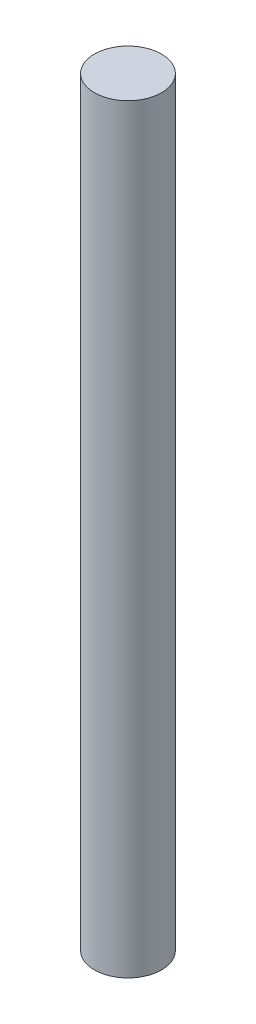
ISO-10303-21;
HEADER;
FILE_DESCRIPTION(('STEP AP214'),'2;1');
FILE_NAME('part.step','',(''),(''),'','','');
FILE_SCHEMA(('AUTOMOTIVE_DESIGN { 1 0 10303 214 1 1 1 1 }'));
ENDSEC;
DATA;
#1=APPLICATION_CONTEXT('core data for automotive mechanical design processes');
#2=APPLICATION_PROTOCOL_DEFINITION('international standard','automotive_design',2000,#1);
#3=PRODUCT_CONTEXT('',#1,'mechanical');
#4=PRODUCT('Part','Part','',(#3));
#5=PRODUCT_RELATED_PRODUCT_CATEGORY('part','',(#4));
#6=PRODUCT_DEFINITION_FORMATION('','',#4);
#7=PRODUCT_DEFINITION_CONTEXT('part definition',#1,'design');
#8=PRODUCT_DEFINITION('design','',#6,#7);
#9=PRODUCT_DEFINITION_SHAPE('','',#8);
#10=(LENGTH_UNIT() NAMED_UNIT(*) SI_UNIT(.MILLI.,.METRE.));
#11=(NAMED_UNIT(*) PLANE_ANGLE_UNIT() SI_UNIT($,.RADIAN.));
#12=(NAMED_UNIT(*) SI_UNIT($,.STERADIAN.) SOLID_ANGLE_UNIT());
#13=UNCERTAINTY_MEASURE_WITH_UNIT(LENGTH_MEASURE(1.E-05),#10,'distance_accuracy_value','');
#14=(GEOMETRIC_REPRESENTATION_CONTEXT(3) GLOBAL_UNCERTAINTY_ASSIGNED_CONTEXT((#13)) GLOBAL_UNIT_ASSIGNED_CONTEXT((#10,
#11,#12)) REPRESENTATION_CONTEXT('',''));
#15=CARTESIAN_POINT('',(0.,0.,0.));
#16=DIRECTION('',(0.,0.,1.));
#17=DIRECTION('',(1.,0.,0.));
#18=AXIS2_PLACEMENT_3D('',#15,#16,#17);
#19=CARTESIAN_POINT('',(0.,90.6018,0.));
#20=DIRECTION('',(0.,-1.,0.));
#21=DIRECTION('',(0.,0.,-1.));
#22=AXIS2_PLACEMENT_3D('',#19,#20,#21);
#23=CYLINDRICAL_SURFACE('',#22,4.);
#24=CARTESIAN_POINT('',(0.,90.6018,0.));
#25=DIRECTION('',(0.,1.,0.));
#26=DIRECTION('',(0.,0.,1.));
#27=AXIS2_PLACEMENT_3D('',#24,#25,#26);
#28=CIRCLE('',#27,4.);
#29=CARTESIAN_POINT('',(0.,90.6018,4.));
#30=VERTEX_POINT('',#29);
#31=EDGE_CURVE('E10',#30,#30,#28,.T.);
#32=ORIENTED_EDGE('',*,*,#31,.F.);
#33=EDGE_LOOP('',(#32));
#34=FACE_BOUND('',#33,.T.);
#35=CARTESIAN_POINT('',(0.,0.,0.));
#36=DIRECTION('',(0.,1.,0.));
#37=DIRECTION('',(0.,0.,1.));
#38=AXIS2_PLACEMENT_3D('',#35,#36,#37);
#39=CIRCLE('',#38,4.);
#40=CARTESIAN_POINT('',(0.,0.,4.));
#41=VERTEX_POINT('',#40);
#42=EDGE_CURVE('E34',#41,#41,#39,.T.);
#43=ORIENTED_EDGE('',*,*,#42,.T.);
#44=EDGE_LOOP('',(#43));
#45=FACE_BOUND('',#44,.T.);
#46=ADVANCED_FACE('F31',(#34,#45),#23,.T.);
#47=CARTESIAN_POINT('',(0.,90.6018,0.));
#48=DIRECTION('',(0.,1.,0.));
#49=DIRECTION('',(0.,0.,1.));
#50=AXIS2_PLACEMENT_3D('',#47,#48,#49);
#51=PLANE('',#50);
#52=ORIENTED_EDGE('',*,*,#31,.T.);
#53=EDGE_LOOP('',(#52));
#54=FACE_BOUND('',#53,.T.);
#55=ADVANCED_FACE('F46',(#54),#51,.T.);
#56=CARTESIAN_POINT('',(0.,0.,0.));
#57=DIRECTION('',(0.,1.,0.));
#58=DIRECTION('',(0.,0.,1.));
#59=AXIS2_PLACEMENT_3D('',#56,#57,#58);
#60=PLANE('',#59);
#61=ORIENTED_EDGE('',*,*,#42,.F.);
#62=EDGE_LOOP('',(#61));
#63=FACE_BOUND('',#62,.T.);
#64=ADVANCED_FACE('F44',(#63),#60,.F.);
#65=CLOSED_SHELL('',(#46,#55,#64));
#66=MANIFOLD_SOLID_BREP('B2',#65);
#67=ADVANCED_BREP_SHAPE_REPRESENTATION('',(#18,#66),#14);
#68=SHAPE_DEFINITION_REPRESENTATION(#9,#67);
ENDSEC;
END-ISO-10303-21;
